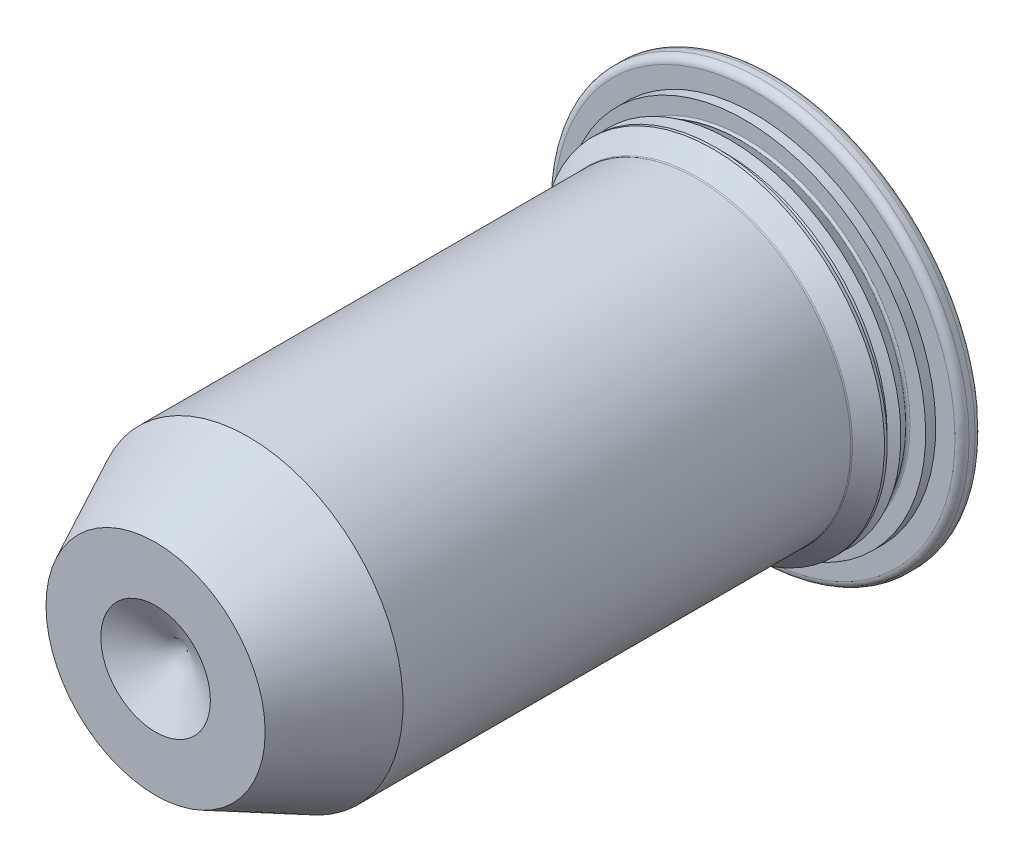
ISO-10303-21;
HEADER;
FILE_DESCRIPTION(('STEP AP214'),'2;1');
FILE_NAME('part.step','',(''),(''),'','','');
FILE_SCHEMA(('AUTOMOTIVE_DESIGN { 1 0 10303 214 1 1 1 1 }'));
ENDSEC;
DATA;
#1=APPLICATION_CONTEXT('core data for automotive mechanical design processes');
#2=APPLICATION_PROTOCOL_DEFINITION('international standard','automotive_design',2000,#1);
#3=PRODUCT_CONTEXT('',#1,'mechanical');
#4=PRODUCT('Part','Part','',(#3));
#5=PRODUCT_RELATED_PRODUCT_CATEGORY('part','',(#4));
#6=PRODUCT_DEFINITION_FORMATION('','',#4);
#7=PRODUCT_DEFINITION_CONTEXT('part definition',#1,'design');
#8=PRODUCT_DEFINITION('design','',#6,#7);
#9=PRODUCT_DEFINITION_SHAPE('','',#8);
#10=(LENGTH_UNIT() NAMED_UNIT(*) SI_UNIT(.MILLI.,.METRE.));
#11=(NAMED_UNIT(*) PLANE_ANGLE_UNIT() SI_UNIT($,.RADIAN.));
#12=(NAMED_UNIT(*) SI_UNIT($,.STERADIAN.) SOLID_ANGLE_UNIT());
#13=UNCERTAINTY_MEASURE_WITH_UNIT(LENGTH_MEASURE(1.E-05),#10,'distance_accuracy_value','');
#14=(GEOMETRIC_REPRESENTATION_CONTEXT(3) GLOBAL_UNCERTAINTY_ASSIGNED_CONTEXT((#13)) GLOBAL_UNIT_ASSIGNED_CONTEXT((#10,
#11,#12)) REPRESENTATION_CONTEXT('',''));
#15=CARTESIAN_POINT('',(0.,0.,0.));
#16=DIRECTION('',(0.,0.,1.));
#17=DIRECTION('',(1.,0.,0.));
#18=AXIS2_PLACEMENT_3D('',#15,#16,#17);
#19=CARTESIAN_POINT('',(0.,0.,-5.425012));
#20=DIRECTION('',(0.,0.,-1.));
#21=DIRECTION('',(0.,1.,0.));
#22=AXIS2_PLACEMENT_3D('',#19,#20,#21);
#23=CONICAL_SURFACE('',#22,3.513963,1.10714961100262);
#24=CARTESIAN_POINT('',(0.,0.,-5.3309875));
#25=DIRECTION('',(0.,0.,1.));
#26=DIRECTION('',(0.,-1.,0.));
#27=AXIS2_PLACEMENT_3D('',#24,#25,#26);
#28=CIRCLE('',#27,3.32591358008183);
#29=CARTESIAN_POINT('',(0.,-3.32591358008182,-5.3309875));
#30=VERTEX_POINT('',#29);
#31=EDGE_CURVE('E155',#30,#30,#28,.T.);
#32=ORIENTED_EDGE('',*,*,#31,.F.);
#33=EDGE_LOOP('',(#32));
#34=FACE_BOUND('',#33,.T.);
#35=CARTESIAN_POINT('',(0.,0.,-5.425012));
#36=DIRECTION('',(0.,0.,1.));
#37=DIRECTION('',(0.,-1.,0.));
#38=AXIS2_PLACEMENT_3D('',#35,#36,#37);
#39=CIRCLE('',#38,3.513963);
#40=CARTESIAN_POINT('',(0.,-3.513963,-5.425012));
#41=VERTEX_POINT('',#40);
#42=EDGE_CURVE('E277',#41,#41,#39,.T.);
#43=ORIENTED_EDGE('',*,*,#42,.T.);
#44=EDGE_LOOP('',(#43));
#45=FACE_BOUND('',#44,.T.);
#46=ADVANCED_FACE('F37',(#34,#45),#23,.T.);
#47=CARTESIAN_POINT('',(0.,0.,-5.2849875));
#48=DIRECTION('',(0.,0.,1.));
#49=DIRECTION('',(0.,-1.,0.));
#50=AXIS2_PLACEMENT_3D('',#47,#48,#49);
#51=TOROIDAL_SURFACE('',#50,3.40558791722999,0.0919999999999997);
#52=CARTESIAN_POINT('',(0.,0.,-5.2389875));
#53=DIRECTION('',(0.,0.,1.));
#54=DIRECTION('',(0.,-1.,0.));
#55=AXIS2_PLACEMENT_3D('',#52,#53,#54);
#56=CIRCLE('',#55,3.32591358008183);
#57=CARTESIAN_POINT('',(0.,-3.32591358008182,-5.2389875));
#58=VERTEX_POINT('',#57);
#59=EDGE_CURVE('E152',#58,#58,#56,.T.);
#60=ORIENTED_EDGE('',*,*,#59,.F.);
#61=EDGE_LOOP('',(#60));
#62=FACE_BOUND('',#61,.T.);
#63=ORIENTED_EDGE('',*,*,#31,.T.);
#64=EDGE_LOOP('',(#63));
#65=FACE_BOUND('',#64,.T.);
#66=ADVANCED_FACE('F66',(#62,#65),#51,.F.);
#67=CARTESIAN_POINT('',(0.,0.,-5.2389875));
#68=DIRECTION('',(0.,0.,1.));
#69=DIRECTION('',(0.,-1.,0.));
#70=AXIS2_PLACEMENT_3D('',#67,#68,#69);
#71=CONICAL_SURFACE('',#70,3.32591358008183,1.10714961100261);
#72=CARTESIAN_POINT('',(0.,0.,-5.144963));
#73=DIRECTION('',(0.,0.,1.));
#74=DIRECTION('',(0.,-1.,0.));
#75=AXIS2_PLACEMENT_3D('',#72,#73,#74);
#76=CIRCLE('',#75,3.513963);
#77=CARTESIAN_POINT('',(0.,-3.513963,-5.144963));
#78=VERTEX_POINT('',#77);
#79=EDGE_CURVE('E143',#78,#78,#76,.T.);
#80=ORIENTED_EDGE('',*,*,#79,.F.);
#81=EDGE_LOOP('',(#80));
#82=FACE_BOUND('',#81,.T.);
#83=ORIENTED_EDGE('',*,*,#59,.T.);
#84=EDGE_LOOP('',(#83));
#85=FACE_BOUND('',#84,.T.);
#86=ADVANCED_FACE('F73',(#82,#85),#71,.T.);
#87=CARTESIAN_POINT('',(0.,0.,6.35));
#88=DIRECTION('',(0.,0.,1.));
#89=DIRECTION('',(0.,-1.,0.));
#90=AXIS2_PLACEMENT_3D('',#87,#88,#89);
#91=CYLINDRICAL_SURFACE('',#90,3.513963);
#92=CARTESIAN_POINT('',(0.,0.,-5.088963));
#93=DIRECTION('',(0.,0.,1.));
#94=DIRECTION('',(0.,-1.,0.));
#95=AXIS2_PLACEMENT_3D('',#92,#93,#94);
#96=CIRCLE('',#95,3.513963);
#97=CARTESIAN_POINT('',(0.,-3.513963,-5.088963));
#98=VERTEX_POINT('',#97);
#99=EDGE_CURVE('E139',#98,#98,#96,.T.);
#100=ORIENTED_EDGE('',*,*,#99,.F.);
#101=EDGE_LOOP('',(#100));
#102=FACE_BOUND('',#101,.T.);
#103=ORIENTED_EDGE('',*,*,#79,.T.);
#104=EDGE_LOOP('',(#103));
#105=FACE_BOUND('',#104,.T.);
#106=ADVANCED_FACE('F186',(#102,#105),#91,.T.);
#107=CARTESIAN_POINT('',(0.,0.,-5.088963));
#108=DIRECTION('',(0.,0.,-1.));
#109=DIRECTION('',(0.,1.,0.));
#110=AXIS2_PLACEMENT_3D('',#107,#108,#109);
#111=CONICAL_SURFACE('',#110,3.513963,0.785398163397447);
#112=CARTESIAN_POINT('',(0.,0.,-4.76115923163679));
#113=DIRECTION('',(0.,0.,-1.));
#114=DIRECTION('',(0.,1.,0.));
#115=AXIS2_PLACEMENT_3D('',#112,#113,#114);
#116=CIRCLE('',#115,3.18615923163679);
#117=CARTESIAN_POINT('',(0.,3.18615923163679,-4.76115923163679));
#118=VERTEX_POINT('',#117);
#119=EDGE_CURVE('E11',#118,#118,#116,.T.);
#120=ORIENTED_EDGE('',*,*,#119,.T.);
#121=EDGE_LOOP('',(#120));
#122=FACE_BOUND('',#121,.T.);
#123=ORIENTED_EDGE('',*,*,#99,.T.);
#124=EDGE_LOOP('',(#123));
#125=FACE_BOUND('',#124,.T.);
#126=ADVANCED_FACE('F133',(#122,#125),#111,.T.);
#127=CARTESIAN_POINT('',(0.,0.,6.35));
#128=DIRECTION('',(0.,0.,1.));
#129=DIRECTION('',(0.,-1.,0.));
#130=AXIS2_PLACEMENT_3D('',#127,#128,#129);
#131=CYLINDRICAL_SURFACE('',#130,3.175);
#132=CARTESIAN_POINT('',(0.,0.,-4.73421846327359));
#133=DIRECTION('',(0.,0.,1.));
#134=DIRECTION('',(0.,-1.,0.));
#135=AXIS2_PLACEMENT_3D('',#132,#133,#134);
#136=CIRCLE('',#135,3.175);
#137=CARTESIAN_POINT('',(0.,-3.175,-4.73421846327359));
#138=VERTEX_POINT('',#137);
#139=EDGE_CURVE('E44',#138,#138,#136,.T.);
#140=ORIENTED_EDGE('',*,*,#139,.T.);
#141=EDGE_LOOP('',(#140));
#142=FACE_BOUND('',#141,.T.);
#143=CARTESIAN_POINT('',(0.,0.,4.44916330847186));
#144=DIRECTION('',(0.,0.,1.));
#145=DIRECTION('',(0.,-1.,0.));
#146=AXIS2_PLACEMENT_3D('',#143,#144,#145);
#147=CIRCLE('',#146,3.175);
#148=CARTESIAN_POINT('',(0.,-3.175,4.44916330847185));
#149=VERTEX_POINT('',#148);
#150=EDGE_CURVE('E137',#149,#149,#147,.T.);
#151=ORIENTED_EDGE('',*,*,#150,.F.);
#152=EDGE_LOOP('',(#151));
#153=FACE_BOUND('',#152,.T.);
#154=ADVANCED_FACE('F129',(#142,#153),#131,.T.);
#155=CARTESIAN_POINT('',(0.,0.,4.44916330847186));
#156=DIRECTION('',(0.,0.,-1.));
#157=DIRECTION('',(0.,1.,0.));
#158=AXIS2_PLACEMENT_3D('',#155,#156,#157);
#159=CONICAL_SURFACE('',#158,3.175,0.45378560551853);
#160=CARTESIAN_POINT('',(0.,0.,6.35));
#161=DIRECTION('',(0.,0.,1.));
#162=DIRECTION('',(0.,-1.,0.));
#163=AXIS2_PLACEMENT_3D('',#160,#161,#162);
#164=CIRCLE('',#163,2.2479);
#165=CARTESIAN_POINT('',(0.,-2.2479,6.35));
#166=VERTEX_POINT('',#165);
#167=EDGE_CURVE('E140',#166,#166,#164,.T.);
#168=ORIENTED_EDGE('',*,*,#167,.F.);
#169=EDGE_LOOP('',(#168));
#170=FACE_BOUND('',#169,.T.);
#171=ORIENTED_EDGE('',*,*,#150,.T.);
#172=EDGE_LOOP('',(#171));
#173=FACE_BOUND('',#172,.T.);
#174=ADVANCED_FACE('F61',(#170,#173),#159,.T.);
#175=CARTESIAN_POINT('',(0.,2.2479,6.35));
#176=DIRECTION('',(0.,0.,-1.));
#177=DIRECTION('',(0.,1.,0.));
#178=AXIS2_PLACEMENT_3D('',#175,#176,#177);
#179=PLANE('',#178);
#180=CARTESIAN_POINT('',(0.,0.,6.35));
#181=DIRECTION('',(0.,0.,1.));
#182=DIRECTION('',(1.,0.,0.));
#183=AXIS2_PLACEMENT_3D('',#180,#181,#182);
#184=CIRCLE('',#183,1.12395);
#185=CARTESIAN_POINT('',(1.12395,0.,6.35));
#186=VERTEX_POINT('',#185);
#187=EDGE_CURVE('E146',#186,#186,#184,.T.);
#188=ORIENTED_EDGE('',*,*,#187,.F.);
#189=EDGE_LOOP('',(#188));
#190=FACE_BOUND('',#189,.T.);
#191=ORIENTED_EDGE('',*,*,#167,.T.);
#192=EDGE_LOOP('',(#191));
#193=FACE_BOUND('',#192,.T.);
#194=ADVANCED_FACE('F50',(#190,#193),#179,.F.);
#195=CARTESIAN_POINT('',(0.,0.,5.70108716494432));
#196=DIRECTION('',(0.,0.,1.));
#197=DIRECTION('',(1.,0.,0.));
#198=AXIS2_PLACEMENT_3D('',#195,#196,#197);
#199=CONICAL_SURFACE('',#198,0.,1.0471975511966);
#200=ORIENTED_EDGE('',*,*,#187,.T.);
#201=EDGE_LOOP('',(#200));
#202=FACE_BOUND('',#201,.T.);
#203=CARTESIAN_POINT('',(0.,0.,5.70108716494432));
#204=VERTEX_POINT('',#203);
#205=VERTEX_LOOP('',#204);
#206=FACE_BOUND('',#205,.T.);
#207=ADVANCED_FACE('F47',(#202,#206),#199,.F.);
#208=CARTESIAN_POINT('',(0.,0.,-5.425012));
#209=DIRECTION('',(0.,0.,1.));
#210=DIRECTION('',(0.,-1.,0.));
#211=AXIS2_PLACEMENT_3D('',#208,#209,#210);
#212=CONICAL_SURFACE('',#211,3.513963,0.549588247716897);
#213=CARTESIAN_POINT('',(0.,0.,-5.67401099246729));
#214=DIRECTION('',(0.,0.,-1.));
#215=DIRECTION('',(0.,1.,0.));
#216=AXIS2_PLACEMENT_3D('',#213,#214,#215);
#217=CIRCLE('',#216,3.36144144920624);
#218=CARTESIAN_POINT('',(0.,3.36144144920624,-5.67401099246729));
#219=VERTEX_POINT('',#218);
#220=EDGE_CURVE('E118',#219,#219,#217,.F.);
#221=ORIENTED_EDGE('',*,*,#220,.T.);
#222=EDGE_LOOP('',(#221));
#223=FACE_BOUND('',#222,.T.);
#224=ORIENTED_EDGE('',*,*,#42,.F.);
#225=EDGE_LOOP('',(#224));
#226=FACE_BOUND('',#225,.T.);
#227=ADVANCED_FACE('F49',(#223,#226),#212,.T.);
#228=CARTESIAN_POINT('',(0.,0.,-6.35));
#229=DIRECTION('',(0.,0.,1.));
#230=DIRECTION('',(0.,-1.,0.));
#231=AXIS2_PLACEMENT_3D('',#228,#229,#230);
#232=PLANE('',#231);
#233=CARTESIAN_POINT('',(0.,0.,-6.35));
#234=DIRECTION('',(0.,0.,1.));
#235=DIRECTION('',(0.,-1.,0.));
#236=AXIS2_PLACEMENT_3D('',#233,#234,#235);
#237=CIRCLE('',#236,4.1105);
#238=CARTESIAN_POINT('',(0.,-4.1105,-6.35));
#239=VERTEX_POINT('',#238);
#240=EDGE_CURVE('E119',#239,#239,#237,.T.);
#241=ORIENTED_EDGE('',*,*,#240,.F.);
#242=EDGE_LOOP('',(#241));
#243=FACE_BOUND('',#242,.T.);
#244=ADVANCED_FACE('F58',(#243),#232,.F.);
#245=CARTESIAN_POINT('',(0.,0.,-6.206));
#246=DIRECTION('',(0.,0.,1.));
#247=DIRECTION('',(0.,-1.,0.));
#248=AXIS2_PLACEMENT_3D('',#245,#246,#247);
#249=TOROIDAL_SURFACE('',#248,4.1105,0.144);
#250=CARTESIAN_POINT('',(0.,0.,-6.206));
#251=DIRECTION('',(0.,0.,1.));
#252=DIRECTION('',(0.,-1.,0.));
#253=AXIS2_PLACEMENT_3D('',#250,#251,#252);
#254=CIRCLE('',#253,4.2545);
#255=CARTESIAN_POINT('',(0.,-4.2545,-6.206));
#256=VERTEX_POINT('',#255);
#257=EDGE_CURVE('E123',#256,#256,#254,.T.);
#258=ORIENTED_EDGE('',*,*,#257,.F.);
#259=EDGE_LOOP('',(#258));
#260=FACE_BOUND('',#259,.T.);
#261=ORIENTED_EDGE('',*,*,#240,.T.);
#262=EDGE_LOOP('',(#261));
#263=FACE_BOUND('',#262,.T.);
#264=ADVANCED_FACE('F99',(#260,#263),#249,.T.);
#265=CARTESIAN_POINT('',(0.,0.,6.35));
#266=DIRECTION('',(0.,0.,1.));
#267=DIRECTION('',(0.,-1.,0.));
#268=AXIS2_PLACEMENT_3D('',#265,#266,#267);
#269=CYLINDRICAL_SURFACE('',#268,4.2545);
#270=CARTESIAN_POINT('',(0.,0.,-6.082012));
#271=DIRECTION('',(0.,0.,1.));
#272=DIRECTION('',(0.,-1.,0.));
#273=AXIS2_PLACEMENT_3D('',#270,#271,#272);
#274=CIRCLE('',#273,4.2545);
#275=CARTESIAN_POINT('',(0.,-4.2545,-6.082012));
#276=VERTEX_POINT('',#275);
#277=EDGE_CURVE('E167',#276,#276,#274,.T.);
#278=ORIENTED_EDGE('',*,*,#277,.F.);
#279=EDGE_LOOP('',(#278));
#280=FACE_BOUND('',#279,.T.);
#281=ORIENTED_EDGE('',*,*,#257,.T.);
#282=EDGE_LOOP('',(#281));
#283=FACE_BOUND('',#282,.T.);
#284=ADVANCED_FACE('F95',(#280,#283),#269,.T.);
#285=CARTESIAN_POINT('',(0.,0.,-6.082012));
#286=DIRECTION('',(0.,0.,1.));
#287=DIRECTION('',(0.,-1.,0.));
#288=AXIS2_PLACEMENT_3D('',#285,#286,#287);
#289=TOROIDAL_SURFACE('',#288,4.1105,0.144);
#290=CARTESIAN_POINT('',(0.,0.,-5.938012));
#291=DIRECTION('',(0.,0.,1.));
#292=DIRECTION('',(0.,-1.,0.));
#293=AXIS2_PLACEMENT_3D('',#290,#291,#292);
#294=CIRCLE('',#293,4.1105);
#295=CARTESIAN_POINT('',(0.,-4.1105,-5.938012));
#296=VERTEX_POINT('',#295);
#297=EDGE_CURVE('E164',#296,#296,#294,.T.);
#298=ORIENTED_EDGE('',*,*,#297,.F.);
#299=EDGE_LOOP('',(#298));
#300=FACE_BOUND('',#299,.T.);
#301=ORIENTED_EDGE('',*,*,#277,.T.);
#302=EDGE_LOOP('',(#301));
#303=FACE_BOUND('',#302,.T.);
#304=ADVANCED_FACE('F91',(#300,#303),#289,.T.);
#305=CARTESIAN_POINT('',(0.,4.1105,-5.938012));
#306=DIRECTION('',(0.,0.,-1.));
#307=DIRECTION('',(0.,1.,0.));
#308=AXIS2_PLACEMENT_3D('',#305,#306,#307);
#309=PLANE('',#308);
#310=CARTESIAN_POINT('',(0.,0.,-5.938012));
#311=DIRECTION('',(0.,0.,1.));
#312=DIRECTION('',(0.,-1.,0.));
#313=AXIS2_PLACEMENT_3D('',#310,#311,#312);
#314=CIRCLE('',#313,3.71475);
#315=CARTESIAN_POINT('',(0.,-3.71475,-5.938012));
#316=VERTEX_POINT('',#315);
#317=EDGE_CURVE('E161',#316,#316,#314,.T.);
#318=ORIENTED_EDGE('',*,*,#317,.F.);
#319=EDGE_LOOP('',(#318));
#320=FACE_BOUND('',#319,.T.);
#321=ORIENTED_EDGE('',*,*,#297,.T.);
#322=EDGE_LOOP('',(#321));
#323=FACE_BOUND('',#322,.T.);
#324=ADVANCED_FACE('F87',(#320,#323),#309,.F.);
#325=CARTESIAN_POINT('',(0.,0.,6.35));
#326=DIRECTION('',(0.,0.,1.));
#327=DIRECTION('',(0.,-1.,0.));
#328=AXIS2_PLACEMENT_3D('',#325,#326,#327);
#329=CYLINDRICAL_SURFACE('',#328,3.71475);
#330=CARTESIAN_POINT('',(0.,0.,-5.732012));
#331=DIRECTION('',(0.,0.,1.));
#332=DIRECTION('',(0.,-1.,0.));
#333=AXIS2_PLACEMENT_3D('',#330,#331,#332);
#334=CIRCLE('',#333,3.71475);
#335=CARTESIAN_POINT('',(0.,-3.71475,-5.732012));
#336=VERTEX_POINT('',#335);
#337=EDGE_CURVE('E158',#336,#336,#334,.T.);
#338=ORIENTED_EDGE('',*,*,#337,.F.);
#339=EDGE_LOOP('',(#338));
#340=FACE_BOUND('',#339,.T.);
#341=ORIENTED_EDGE('',*,*,#317,.T.);
#342=EDGE_LOOP('',(#341));
#343=FACE_BOUND('',#342,.T.);
#344=ADVANCED_FACE('F84',(#340,#343),#329,.T.);
#345=CARTESIAN_POINT('',(0.,3.71475,-5.732012));
#346=DIRECTION('',(0.,0.,-1.));
#347=DIRECTION('',(0.,1.,0.));
#348=AXIS2_PLACEMENT_3D('',#345,#346,#347);
#349=PLANE('',#348);
#350=CARTESIAN_POINT('',(0.,0.,-5.732012));
#351=DIRECTION('',(0.,0.,-1.));
#352=DIRECTION('',(0.,1.,0.));
#353=AXIS2_PLACEMENT_3D('',#350,#351,#352);
#354=CIRCLE('',#353,3.39393083053589);
#355=CARTESIAN_POINT('',(0.,3.39393083053589,-5.732012));
#356=VERTEX_POINT('',#355);
#357=EDGE_CURVE('E115',#356,#356,#354,.T.);
#358=ORIENTED_EDGE('',*,*,#357,.T.);
#359=EDGE_LOOP('',(#358));
#360=FACE_BOUND('',#359,.T.);
#361=ORIENTED_EDGE('',*,*,#337,.T.);
#362=EDGE_LOOP('',(#361));
#363=FACE_BOUND('',#362,.T.);
#364=ADVANCED_FACE('F80',(#360,#363),#349,.F.);
#365=CARTESIAN_POINT('',(0.,0.,-5.693912));
#366=DIRECTION('',(0.,0.,-1.));
#367=DIRECTION('',(0.,1.,0.));
#368=AXIS2_PLACEMENT_3D('',#365,#366,#367);
#369=TOROIDAL_SURFACE('',#368,3.39393083053589,0.0381);
#370=ORIENTED_EDGE('',*,*,#357,.F.);
#371=EDGE_LOOP('',(#370));
#372=FACE_BOUND('',#371,.T.);
#373=ORIENTED_EDGE('',*,*,#220,.F.);
#374=EDGE_LOOP('',(#373));
#375=FACE_BOUND('',#374,.T.);
#376=ADVANCED_FACE('F83',(#372,#375),#369,.F.);
#377=CARTESIAN_POINT('',(0.,0.,-4.73421846327358));
#378=DIRECTION('',(0.,0.,1.));
#379=DIRECTION('',(0.,-1.,0.));
#380=AXIS2_PLACEMENT_3D('',#377,#378,#379);
#381=TOROIDAL_SURFACE('',#380,3.2131,0.0381);
#382=ORIENTED_EDGE('',*,*,#119,.F.);
#383=EDGE_LOOP('',(#382));
#384=FACE_BOUND('',#383,.T.);
#385=ORIENTED_EDGE('',*,*,#139,.F.);
#386=EDGE_LOOP('',(#385));
#387=FACE_BOUND('',#386,.T.);
#388=ADVANCED_FACE('F39',(#384,#387),#381,.F.);
#389=CLOSED_SHELL('',(#46,#66,#86,#106,#126,#154,#174,#194,#207,#227,#244,#264,#284,#304,#324,
#344,#364,#376,#388));
#390=MANIFOLD_SOLID_BREP('B2',#389);
#391=ADVANCED_BREP_SHAPE_REPRESENTATION('',(#18,#390),#14);
#392=SHAPE_DEFINITION_REPRESENTATION(#9,#391);
ENDSEC;
END-ISO-10303-21;
